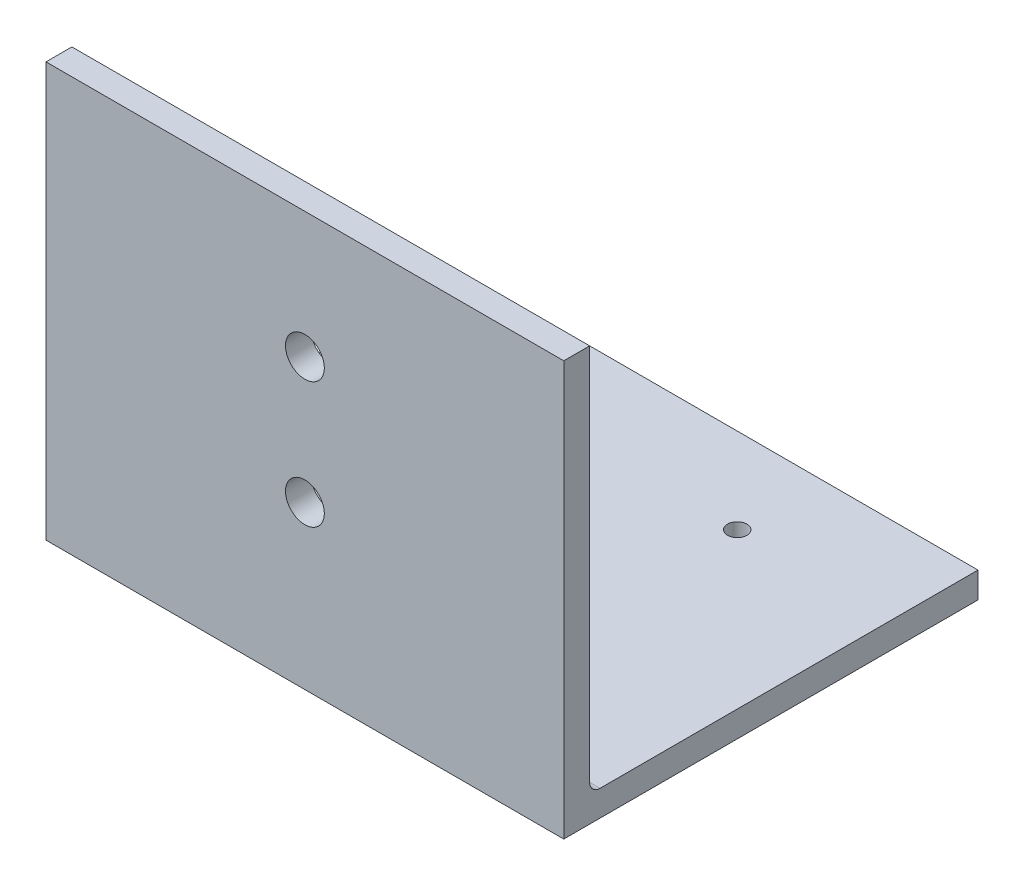
ISO-10303-21;
HEADER;
FILE_DESCRIPTION(('STEP AP214'),'2;1');
FILE_NAME('part.step','',(''),(''),'','','');
FILE_SCHEMA(('AUTOMOTIVE_DESIGN { 1 0 10303 214 1 1 1 1 }'));
ENDSEC;
DATA;
#1=APPLICATION_CONTEXT('core data for automotive mechanical design processes');
#2=APPLICATION_PROTOCOL_DEFINITION('international standard','automotive_design',2000,#1);
#3=PRODUCT_CONTEXT('',#1,'mechanical');
#4=PRODUCT('Part','Part','',(#3));
#5=PRODUCT_RELATED_PRODUCT_CATEGORY('part','',(#4));
#6=PRODUCT_DEFINITION_FORMATION('','',#4);
#7=PRODUCT_DEFINITION_CONTEXT('part definition',#1,'design');
#8=PRODUCT_DEFINITION('design','',#6,#7);
#9=PRODUCT_DEFINITION_SHAPE('','',#8);
#10=(LENGTH_UNIT() NAMED_UNIT(*) SI_UNIT(.MILLI.,.METRE.));
#11=(NAMED_UNIT(*) PLANE_ANGLE_UNIT() SI_UNIT($,.RADIAN.));
#12=(NAMED_UNIT(*) SI_UNIT($,.STERADIAN.) SOLID_ANGLE_UNIT());
#13=UNCERTAINTY_MEASURE_WITH_UNIT(LENGTH_MEASURE(1.E-05),#10,'distance_accuracy_value','');
#14=(GEOMETRIC_REPRESENTATION_CONTEXT(3) GLOBAL_UNCERTAINTY_ASSIGNED_CONTEXT((#13)) GLOBAL_UNIT_ASSIGNED_CONTEXT((#10,
#11,#12)) REPRESENTATION_CONTEXT('',''));
#15=CARTESIAN_POINT('',(0.,0.,0.));
#16=DIRECTION('',(0.,0.,1.));
#17=DIRECTION('',(1.,0.,0.));
#18=AXIS2_PLACEMENT_3D('',#15,#16,#17);
#19=CARTESIAN_POINT('',(127.,0.,-101.6));
#20=DIRECTION('',(0.,1.,0.));
#21=DIRECTION('',(0.,0.,1.));
#22=AXIS2_PLACEMENT_3D('',#19,#20,#21);
#23=PLANE('',#22);
#24=CARTESIAN_POINT('',(88.9,0.,-80.645));
#25=DIRECTION('',(0.,1.,0.));
#26=DIRECTION('',(0.,0.,1.));
#27=AXIS2_PLACEMENT_3D('',#24,#25,#26);
#28=CIRCLE('',#27,2.38125);
#29=CARTESIAN_POINT('',(88.9,0.,-78.26375));
#30=VERTEX_POINT('',#29);
#31=EDGE_CURVE('E197',#30,#30,#28,.F.);
#32=ORIENTED_EDGE('',*,*,#31,.F.);
#33=EDGE_LOOP('',(#32));
#34=FACE_BOUND('',#33,.T.);
#35=CARTESIAN_POINT('',(38.1,0.,-29.845));
#36=DIRECTION('',(0.,1.,0.));
#37=DIRECTION('',(0.,0.,1.));
#38=AXIS2_PLACEMENT_3D('',#35,#36,#37);
#39=CIRCLE('',#38,2.38125);
#40=CARTESIAN_POINT('',(38.1,0.,-27.46375));
#41=VERTEX_POINT('',#40);
#42=EDGE_CURVE('E198',#41,#41,#39,.F.);
#43=ORIENTED_EDGE('',*,*,#42,.F.);
#44=EDGE_LOOP('',(#43));
#45=FACE_BOUND('',#44,.T.);
#46=CARTESIAN_POINT('',(88.9,0.,-29.845));
#47=DIRECTION('',(0.,1.,0.));
#48=DIRECTION('',(0.,0.,1.));
#49=AXIS2_PLACEMENT_3D('',#46,#47,#48);
#50=CIRCLE('',#49,2.38125000000001);
#51=CARTESIAN_POINT('',(88.9,0.,-27.46375));
#52=VERTEX_POINT('',#51);
#53=EDGE_CURVE('E207',#52,#52,#50,.F.);
#54=ORIENTED_EDGE('',*,*,#53,.F.);
#55=EDGE_LOOP('',(#54));
#56=FACE_BOUND('',#55,.T.);
#57=CARTESIAN_POINT('',(38.1,0.,-80.645));
#58=DIRECTION('',(0.,1.,0.));
#59=DIRECTION('',(0.,0.,1.));
#60=AXIS2_PLACEMENT_3D('',#57,#58,#59);
#61=CIRCLE('',#60,2.38125);
#62=CARTESIAN_POINT('',(38.1,0.,-78.26375));
#63=VERTEX_POINT('',#62);
#64=EDGE_CURVE('E183',#63,#63,#61,.F.);
#65=ORIENTED_EDGE('',*,*,#64,.F.);
#66=EDGE_LOOP('',(#65));
#67=FACE_BOUND('',#66,.T.);
#68=DIRECTION('',(0.,0.,-1.));
#69=VECTOR('',#68,1.);
#70=CARTESIAN_POINT('',(0.,0.,-101.6));
#71=LINE('',#70,#69);
#72=CARTESIAN_POINT('',(0.,0.,0.));
#73=VERTEX_POINT('',#72);
#74=CARTESIAN_POINT('',(0.,0.,-101.6));
#75=VERTEX_POINT('',#74);
#76=EDGE_CURVE('E123',#73,#75,#71,.T.);
#77=ORIENTED_EDGE('',*,*,#76,.T.);
#78=DIRECTION('',(-1.,0.,0.));
#79=VECTOR('',#78,1.);
#80=CARTESIAN_POINT('',(127.,0.,-101.6));
#81=LINE('',#80,#79);
#82=CARTESIAN_POINT('',(127.,0.,-101.6));
#83=VERTEX_POINT('',#82);
#84=EDGE_CURVE('E103',#83,#75,#81,.T.);
#85=ORIENTED_EDGE('',*,*,#84,.F.);
#86=DIRECTION('',(0.,0.,-1.));
#87=VECTOR('',#86,1.);
#88=CARTESIAN_POINT('',(127.,0.,-101.6));
#89=LINE('',#88,#87);
#90=CARTESIAN_POINT('',(127.,0.,0.));
#91=VERTEX_POINT('',#90);
#92=EDGE_CURVE('E110',#91,#83,#89,.T.);
#93=ORIENTED_EDGE('',*,*,#92,.F.);
#94=DIRECTION('',(-1.,0.,0.));
#95=VECTOR('',#94,1.);
#96=CARTESIAN_POINT('',(127.,0.,0.));
#97=LINE('',#96,#95);
#98=EDGE_CURVE('E144',#91,#73,#97,.T.);
#99=ORIENTED_EDGE('',*,*,#98,.T.);
#100=EDGE_LOOP('',(#77,#85,#93,#99));
#101=FACE_BOUND('',#100,.T.);
#102=ADVANCED_FACE('F39',(#34,#45,#56,#67,#101),#23,.F.);
#103=CARTESIAN_POINT('',(127.,6.35,-101.6));
#104=DIRECTION('',(0.,0.,1.));
#105=DIRECTION('',(1.,0.,0.));
#106=AXIS2_PLACEMENT_3D('',#103,#104,#105);
#107=PLANE('',#106);
#108=DIRECTION('',(0.,1.,0.));
#109=VECTOR('',#108,1.);
#110=CARTESIAN_POINT('',(0.,6.35,-101.6));
#111=LINE('',#110,#109);
#112=CARTESIAN_POINT('',(0.,6.35,-101.6));
#113=VERTEX_POINT('',#112);
#114=EDGE_CURVE('E158',#75,#113,#111,.T.);
#115=ORIENTED_EDGE('',*,*,#114,.T.);
#116=DIRECTION('',(-1.,0.,0.));
#117=VECTOR('',#116,1.);
#118=CARTESIAN_POINT('',(127.,6.35,-101.6));
#119=LINE('',#118,#117);
#120=CARTESIAN_POINT('',(127.,6.35,-101.6));
#121=VERTEX_POINT('',#120);
#122=EDGE_CURVE('E106',#121,#113,#119,.T.);
#123=ORIENTED_EDGE('',*,*,#122,.F.);
#124=DIRECTION('',(0.,1.,0.));
#125=VECTOR('',#124,1.);
#126=CARTESIAN_POINT('',(127.,6.35,-101.6));
#127=LINE('',#126,#125);
#128=EDGE_CURVE('E99',#83,#121,#127,.T.);
#129=ORIENTED_EDGE('',*,*,#128,.F.);
#130=ORIENTED_EDGE('',*,*,#84,.T.);
#131=EDGE_LOOP('',(#115,#123,#129,#130));
#132=FACE_BOUND('',#131,.T.);
#133=ADVANCED_FACE('F101',(#132),#107,.F.);
#134=CARTESIAN_POINT('',(127.,6.35,-6.35));
#135=DIRECTION('',(0.,-1.,0.));
#136=DIRECTION('',(0.,0.,-1.));
#137=AXIS2_PLACEMENT_3D('',#134,#135,#136);
#138=PLANE('',#137);
#139=CARTESIAN_POINT('',(88.9,6.35,-80.645));
#140=DIRECTION('',(0.,1.,0.));
#141=DIRECTION('',(0.,0.,1.));
#142=AXIS2_PLACEMENT_3D('',#139,#140,#141);
#143=CIRCLE('',#142,2.38125);
#144=CARTESIAN_POINT('',(88.9,6.35,-78.26375));
#145=VERTEX_POINT('',#144);
#146=EDGE_CURVE('E202',#145,#145,#143,.T.);
#147=ORIENTED_EDGE('',*,*,#146,.F.);
#148=EDGE_LOOP('',(#147));
#149=FACE_BOUND('',#148,.T.);
#150=CARTESIAN_POINT('',(38.1,6.35,-29.845));
#151=DIRECTION('',(0.,1.,0.));
#152=DIRECTION('',(0.,0.,1.));
#153=AXIS2_PLACEMENT_3D('',#150,#151,#152);
#154=CIRCLE('',#153,2.38125);
#155=CARTESIAN_POINT('',(38.1,6.35,-27.46375));
#156=VERTEX_POINT('',#155);
#157=EDGE_CURVE('E203',#156,#156,#154,.T.);
#158=ORIENTED_EDGE('',*,*,#157,.F.);
#159=EDGE_LOOP('',(#158));
#160=FACE_BOUND('',#159,.T.);
#161=CARTESIAN_POINT('',(88.9,6.35,-29.845));
#162=DIRECTION('',(0.,1.,0.));
#163=DIRECTION('',(0.,0.,1.));
#164=AXIS2_PLACEMENT_3D('',#161,#162,#163);
#165=CIRCLE('',#164,2.38125000000001);
#166=CARTESIAN_POINT('',(88.9,6.35,-27.46375));
#167=VERTEX_POINT('',#166);
#168=EDGE_CURVE('E217',#167,#167,#165,.T.);
#169=ORIENTED_EDGE('',*,*,#168,.F.);
#170=EDGE_LOOP('',(#169));
#171=FACE_BOUND('',#170,.T.);
#172=CARTESIAN_POINT('',(38.1,6.35,-80.645));
#173=DIRECTION('',(0.,1.,0.));
#174=DIRECTION('',(0.,0.,1.));
#175=AXIS2_PLACEMENT_3D('',#172,#173,#174);
#176=CIRCLE('',#175,2.38125);
#177=CARTESIAN_POINT('',(38.1,6.35,-78.26375));
#178=VERTEX_POINT('',#177);
#179=EDGE_CURVE('E193',#178,#178,#176,.T.);
#180=ORIENTED_EDGE('',*,*,#179,.F.);
#181=EDGE_LOOP('',(#180));
#182=FACE_BOUND('',#181,.T.);
#183=DIRECTION('',(0.,0.,1.));
#184=VECTOR('',#183,1.);
#185=CARTESIAN_POINT('',(0.,6.35,-6.35));
#186=LINE('',#185,#184);
#187=CARTESIAN_POINT('',(0.,6.35,-8.89));
#188=VERTEX_POINT('',#187);
#189=EDGE_CURVE('E155',#113,#188,#186,.T.);
#190=ORIENTED_EDGE('',*,*,#189,.T.);
#191=DIRECTION('',(-1.,0.,0.));
#192=VECTOR('',#191,1.);
#193=CARTESIAN_POINT('',(127.,6.35,-8.89));
#194=LINE('',#193,#192);
#195=CARTESIAN_POINT('',(127.,6.35,-8.89));
#196=VERTEX_POINT('',#195);
#197=EDGE_CURVE('E55',#188,#196,#194,.F.);
#198=ORIENTED_EDGE('',*,*,#197,.T.);
#199=DIRECTION('',(0.,0.,1.));
#200=VECTOR('',#199,1.);
#201=CARTESIAN_POINT('',(127.,6.35,-6.35));
#202=LINE('',#201,#200);
#203=EDGE_CURVE('E109',#121,#196,#202,.T.);
#204=ORIENTED_EDGE('',*,*,#203,.F.);
#205=ORIENTED_EDGE('',*,*,#122,.T.);
#206=EDGE_LOOP('',(#190,#198,#204,#205));
#207=FACE_BOUND('',#206,.T.);
#208=ADVANCED_FACE('F224',(#149,#160,#171,#182,#207),#138,.F.);
#209=CARTESIAN_POINT('',(127.,101.6,-6.35));
#210=DIRECTION('',(0.,0.,1.));
#211=DIRECTION('',(1.,0.,0.));
#212=AXIS2_PLACEMENT_3D('',#209,#210,#211);
#213=PLANE('',#212);
#214=CARTESIAN_POINT('',(63.5,70.6966666666667,-6.35));
#215=DIRECTION('',(0.,0.,-1.));
#216=DIRECTION('',(-1.,0.,0.));
#217=AXIS2_PLACEMENT_3D('',#214,#215,#216);
#218=CIRCLE('',#217,4.7625);
#219=CARTESIAN_POINT('',(58.7375,70.6966666666667,-6.35));
#220=VERTEX_POINT('',#219);
#221=EDGE_CURVE('E178',#220,#220,#218,.T.);
#222=ORIENTED_EDGE('',*,*,#221,.F.);
#223=EDGE_LOOP('',(#222));
#224=FACE_BOUND('',#223,.T.);
#225=CARTESIAN_POINT('',(63.5,39.7933332486667,-6.35));
#226=DIRECTION('',(0.,0.,-1.));
#227=DIRECTION('',(-1.,0.,0.));
#228=AXIS2_PLACEMENT_3D('',#225,#226,#227);
#229=CIRCLE('',#228,4.7625);
#230=CARTESIAN_POINT('',(58.7375,39.7933332486667,-6.35));
#231=VERTEX_POINT('',#230);
#232=EDGE_CURVE('E179',#231,#231,#229,.T.);
#233=ORIENTED_EDGE('',*,*,#232,.F.);
#234=EDGE_LOOP('',(#233));
#235=FACE_BOUND('',#234,.T.);
#236=DIRECTION('',(0.,1.,0.));
#237=VECTOR('',#236,1.);
#238=CARTESIAN_POINT('',(127.,101.6,-6.35));
#239=LINE('',#238,#237);
#240=CARTESIAN_POINT('',(127.,8.89,-6.35));
#241=VERTEX_POINT('',#240);
#242=CARTESIAN_POINT('',(127.,101.6,-6.35));
#243=VERTEX_POINT('',#242);
#244=EDGE_CURVE('E169',#241,#243,#239,.T.);
#245=ORIENTED_EDGE('',*,*,#244,.F.);
#246=DIRECTION('',(-1.,0.,0.));
#247=VECTOR('',#246,1.);
#248=CARTESIAN_POINT('',(0.,8.89,-6.35));
#249=LINE('',#248,#247);
#250=CARTESIAN_POINT('',(0.,8.89,-6.35));
#251=VERTEX_POINT('',#250);
#252=EDGE_CURVE('E125',#241,#251,#249,.T.);
#253=ORIENTED_EDGE('',*,*,#252,.T.);
#254=DIRECTION('',(0.,1.,0.));
#255=VECTOR('',#254,1.);
#256=CARTESIAN_POINT('',(0.,101.6,-6.35));
#257=LINE('',#256,#255);
#258=CARTESIAN_POINT('',(0.,101.6,-6.35));
#259=VERTEX_POINT('',#258);
#260=EDGE_CURVE('E152',#251,#259,#257,.T.);
#261=ORIENTED_EDGE('',*,*,#260,.T.);
#262=DIRECTION('',(-1.,0.,0.));
#263=VECTOR('',#262,1.);
#264=CARTESIAN_POINT('',(127.,101.6,-6.35));
#265=LINE('',#264,#263);
#266=EDGE_CURVE('E131',#243,#259,#265,.T.);
#267=ORIENTED_EDGE('',*,*,#266,.F.);
#268=EDGE_LOOP('',(#245,#253,#261,#267));
#269=FACE_BOUND('',#268,.T.);
#270=ADVANCED_FACE('F227',(#224,#235,#269),#213,.F.);
#271=CARTESIAN_POINT('',(127.,101.6,0.));
#272=DIRECTION('',(0.,-1.,0.));
#273=DIRECTION('',(0.,0.,-1.));
#274=AXIS2_PLACEMENT_3D('',#271,#272,#273);
#275=PLANE('',#274);
#276=DIRECTION('',(0.,0.,1.));
#277=VECTOR('',#276,1.);
#278=CARTESIAN_POINT('',(0.,101.6,0.));
#279=LINE('',#278,#277);
#280=CARTESIAN_POINT('',(0.,101.6,0.));
#281=VERTEX_POINT('',#280);
#282=EDGE_CURVE('E149',#259,#281,#279,.T.);
#283=ORIENTED_EDGE('',*,*,#282,.T.);
#284=DIRECTION('',(-1.,0.,0.));
#285=VECTOR('',#284,1.);
#286=CARTESIAN_POINT('',(127.,101.6,0.));
#287=LINE('',#286,#285);
#288=CARTESIAN_POINT('',(127.,101.6,0.));
#289=VERTEX_POINT('',#288);
#290=EDGE_CURVE('E140',#289,#281,#287,.T.);
#291=ORIENTED_EDGE('',*,*,#290,.F.);
#292=DIRECTION('',(0.,0.,1.));
#293=VECTOR('',#292,1.);
#294=CARTESIAN_POINT('',(127.,101.6,0.));
#295=LINE('',#294,#293);
#296=EDGE_CURVE('E166',#243,#289,#295,.T.);
#297=ORIENTED_EDGE('',*,*,#296,.F.);
#298=ORIENTED_EDGE('',*,*,#266,.T.);
#299=EDGE_LOOP('',(#283,#291,#297,#298));
#300=FACE_BOUND('',#299,.T.);
#301=ADVANCED_FACE('F241',(#300),#275,.F.);
#302=CARTESIAN_POINT('',(127.,0.,0.));
#303=DIRECTION('',(0.,0.,-1.));
#304=DIRECTION('',(-1.,0.,0.));
#305=AXIS2_PLACEMENT_3D('',#302,#303,#304);
#306=PLANE('',#305);
#307=CARTESIAN_POINT('',(63.5,70.6966666666667,0.));
#308=DIRECTION('',(0.,0.,-1.));
#309=DIRECTION('',(-1.,0.,0.));
#310=AXIS2_PLACEMENT_3D('',#307,#308,#309);
#311=CIRCLE('',#310,4.7625);
#312=CARTESIAN_POINT('',(58.7375,70.6966666666667,0.));
#313=VERTEX_POINT('',#312);
#314=EDGE_CURVE('E163',#313,#313,#311,.F.);
#315=ORIENTED_EDGE('',*,*,#314,.F.);
#316=EDGE_LOOP('',(#315));
#317=FACE_BOUND('',#316,.T.);
#318=CARTESIAN_POINT('',(63.5,39.7933332486667,0.));
#319=DIRECTION('',(0.,0.,-1.));
#320=DIRECTION('',(-1.,0.,0.));
#321=AXIS2_PLACEMENT_3D('',#318,#319,#320);
#322=CIRCLE('',#321,4.7625);
#323=CARTESIAN_POINT('',(58.7375,39.7933332486667,0.));
#324=VERTEX_POINT('',#323);
#325=EDGE_CURVE('E174',#324,#324,#322,.F.);
#326=ORIENTED_EDGE('',*,*,#325,.F.);
#327=EDGE_LOOP('',(#326));
#328=FACE_BOUND('',#327,.T.);
#329=DIRECTION('',(0.,-1.,0.));
#330=VECTOR('',#329,1.);
#331=CARTESIAN_POINT('',(0.,0.,0.));
#332=LINE('',#331,#330);
#333=EDGE_CURVE('E120',#281,#73,#332,.T.);
#334=ORIENTED_EDGE('',*,*,#333,.T.);
#335=ORIENTED_EDGE('',*,*,#98,.F.);
#336=DIRECTION('',(0.,-1.,0.));
#337=VECTOR('',#336,1.);
#338=CARTESIAN_POINT('',(127.,0.,0.));
#339=LINE('',#338,#337);
#340=EDGE_CURVE('E115',#289,#91,#339,.T.);
#341=ORIENTED_EDGE('',*,*,#340,.F.);
#342=ORIENTED_EDGE('',*,*,#290,.T.);
#343=EDGE_LOOP('',(#334,#335,#341,#342));
#344=FACE_BOUND('',#343,.T.);
#345=ADVANCED_FACE('F244',(#317,#328,#344),#306,.F.);
#346=CARTESIAN_POINT('',(127.,0.,0.));
#347=DIRECTION('',(-1.,0.,0.));
#348=DIRECTION('',(0.,0.,1.));
#349=AXIS2_PLACEMENT_3D('',#346,#347,#348);
#350=PLANE('',#349);
#351=ORIENTED_EDGE('',*,*,#92,.T.);
#352=ORIENTED_EDGE('',*,*,#128,.T.);
#353=ORIENTED_EDGE('',*,*,#203,.T.);
#354=CARTESIAN_POINT('',(127.,8.89,-8.89));
#355=DIRECTION('',(-1.,0.,0.));
#356=DIRECTION('',(0.,0.,1.));
#357=AXIS2_PLACEMENT_3D('',#354,#355,#356);
#358=CIRCLE('',#357,2.54);
#359=EDGE_CURVE('E11',#196,#241,#358,.T.);
#360=ORIENTED_EDGE('',*,*,#359,.T.);
#361=ORIENTED_EDGE('',*,*,#244,.T.);
#362=ORIENTED_EDGE('',*,*,#296,.T.);
#363=ORIENTED_EDGE('',*,*,#340,.T.);
#364=EDGE_LOOP('',(#351,#352,#353,#360,#361,#362,#363));
#365=FACE_BOUND('',#364,.T.);
#366=ADVANCED_FACE('F113',(#365),#350,.F.);
#367=CARTESIAN_POINT('',(0.,0.,0.));
#368=DIRECTION('',(-1.,0.,0.));
#369=DIRECTION('',(0.,0.,1.));
#370=AXIS2_PLACEMENT_3D('',#367,#368,#369);
#371=PLANE('',#370);
#372=ORIENTED_EDGE('',*,*,#76,.F.);
#373=ORIENTED_EDGE('',*,*,#333,.F.);
#374=ORIENTED_EDGE('',*,*,#282,.F.);
#375=ORIENTED_EDGE('',*,*,#260,.F.);
#376=CARTESIAN_POINT('',(0.,8.89,-8.89));
#377=DIRECTION('',(-1.,0.,0.));
#378=DIRECTION('',(0.,0.,1.));
#379=AXIS2_PLACEMENT_3D('',#376,#377,#378);
#380=CIRCLE('',#379,2.54);
#381=EDGE_CURVE('E48',#251,#188,#380,.F.);
#382=ORIENTED_EDGE('',*,*,#381,.T.);
#383=ORIENTED_EDGE('',*,*,#189,.F.);
#384=ORIENTED_EDGE('',*,*,#114,.F.);
#385=EDGE_LOOP('',(#372,#373,#374,#375,#382,#383,#384));
#386=FACE_BOUND('',#385,.T.);
#387=ADVANCED_FACE('F245',(#386),#371,.T.);
#388=CARTESIAN_POINT('',(127.,8.89,-8.89));
#389=DIRECTION('',(1.,0.,0.));
#390=DIRECTION('',(0.,0.,-1.));
#391=AXIS2_PLACEMENT_3D('',#388,#389,#390);
#392=CYLINDRICAL_SURFACE('',#391,2.54);
#393=ORIENTED_EDGE('',*,*,#359,.F.);
#394=ORIENTED_EDGE('',*,*,#197,.F.);
#395=ORIENTED_EDGE('',*,*,#381,.F.);
#396=ORIENTED_EDGE('',*,*,#252,.F.);
#397=EDGE_LOOP('',(#393,#394,#395,#396));
#398=FACE_BOUND('',#397,.T.);
#399=ADVANCED_FACE('F41',(#398),#392,.F.);
#400=CARTESIAN_POINT('',(63.5,39.7933332486667,13.4703841816037));
#401=DIRECTION('',(0.,0.,-1.));
#402=DIRECTION('',(-1.,0.,0.));
#403=AXIS2_PLACEMENT_3D('',#400,#401,#402);
#404=CYLINDRICAL_SURFACE('',#403,4.7625);
#405=ORIENTED_EDGE('',*,*,#325,.T.);
#406=EDGE_LOOP('',(#405));
#407=FACE_BOUND('',#406,.T.);
#408=ORIENTED_EDGE('',*,*,#232,.T.);
#409=EDGE_LOOP('',(#408));
#410=FACE_BOUND('',#409,.T.);
#411=ADVANCED_FACE('F252',(#407,#410),#404,.F.);
#412=CARTESIAN_POINT('',(63.5,70.6966666666667,13.4703841816037));
#413=DIRECTION('',(0.,0.,-1.));
#414=DIRECTION('',(-1.,0.,0.));
#415=AXIS2_PLACEMENT_3D('',#412,#413,#414);
#416=CYLINDRICAL_SURFACE('',#415,4.7625);
#417=ORIENTED_EDGE('',*,*,#314,.T.);
#418=EDGE_LOOP('',(#417));
#419=FACE_BOUND('',#418,.T.);
#420=ORIENTED_EDGE('',*,*,#221,.T.);
#421=EDGE_LOOP('',(#420));
#422=FACE_BOUND('',#421,.T.);
#423=ADVANCED_FACE('F278',(#419,#422),#416,.F.);
#424=CARTESIAN_POINT('',(38.1,-6.73519209080188,-80.645));
#425=DIRECTION('',(0.,1.,0.));
#426=DIRECTION('',(0.,0.,1.));
#427=AXIS2_PLACEMENT_3D('',#424,#425,#426);
#428=CYLINDRICAL_SURFACE('',#427,2.38125);
#429=ORIENTED_EDGE('',*,*,#64,.T.);
#430=EDGE_LOOP('',(#429));
#431=FACE_BOUND('',#430,.T.);
#432=ORIENTED_EDGE('',*,*,#179,.T.);
#433=EDGE_LOOP('',(#432));
#434=FACE_BOUND('',#433,.T.);
#435=ADVANCED_FACE('F285',(#431,#434),#428,.F.);
#436=CARTESIAN_POINT('',(88.9,-6.73519209080188,-29.845));
#437=DIRECTION('',(0.,1.,0.));
#438=DIRECTION('',(0.,0.,1.));
#439=AXIS2_PLACEMENT_3D('',#436,#437,#438);
#440=CYLINDRICAL_SURFACE('',#439,2.38125000000001);
#441=ORIENTED_EDGE('',*,*,#53,.T.);
#442=EDGE_LOOP('',(#441));
#443=FACE_BOUND('',#442,.T.);
#444=ORIENTED_EDGE('',*,*,#168,.T.);
#445=EDGE_LOOP('',(#444));
#446=FACE_BOUND('',#445,.T.);
#447=ADVANCED_FACE('F222',(#443,#446),#440,.F.);
#448=CARTESIAN_POINT('',(38.1,-6.73519209080188,-29.845));
#449=DIRECTION('',(0.,1.,0.));
#450=DIRECTION('',(0.,0.,1.));
#451=AXIS2_PLACEMENT_3D('',#448,#449,#450);
#452=CYLINDRICAL_SURFACE('',#451,2.38125);
#453=ORIENTED_EDGE('',*,*,#42,.T.);
#454=EDGE_LOOP('',(#453));
#455=FACE_BOUND('',#454,.T.);
#456=ORIENTED_EDGE('',*,*,#157,.T.);
#457=EDGE_LOOP('',(#456));
#458=FACE_BOUND('',#457,.T.);
#459=ADVANCED_FACE('F292',(#455,#458),#452,.F.);
#460=CARTESIAN_POINT('',(88.9,-6.73519209080188,-80.645));
#461=DIRECTION('',(0.,1.,0.));
#462=DIRECTION('',(0.,0.,1.));
#463=AXIS2_PLACEMENT_3D('',#460,#461,#462);
#464=CYLINDRICAL_SURFACE('',#463,2.38125);
#465=ORIENTED_EDGE('',*,*,#31,.T.);
#466=EDGE_LOOP('',(#465));
#467=FACE_BOUND('',#466,.T.);
#468=ORIENTED_EDGE('',*,*,#146,.T.);
#469=EDGE_LOOP('',(#468));
#470=FACE_BOUND('',#469,.T.);
#471=ADVANCED_FACE('F295',(#467,#470),#464,.F.);
#472=CLOSED_SHELL('',(#102,#133,#208,#270,#301,#345,#366,#387,#399,#411,#423,#435,#447,#459,#471));
#473=MANIFOLD_SOLID_BREP('B2',#472);
#474=ADVANCED_BREP_SHAPE_REPRESENTATION('',(#18,#473),#14);
#475=SHAPE_DEFINITION_REPRESENTATION(#9,#474);
ENDSEC;
END-ISO-10303-21;
